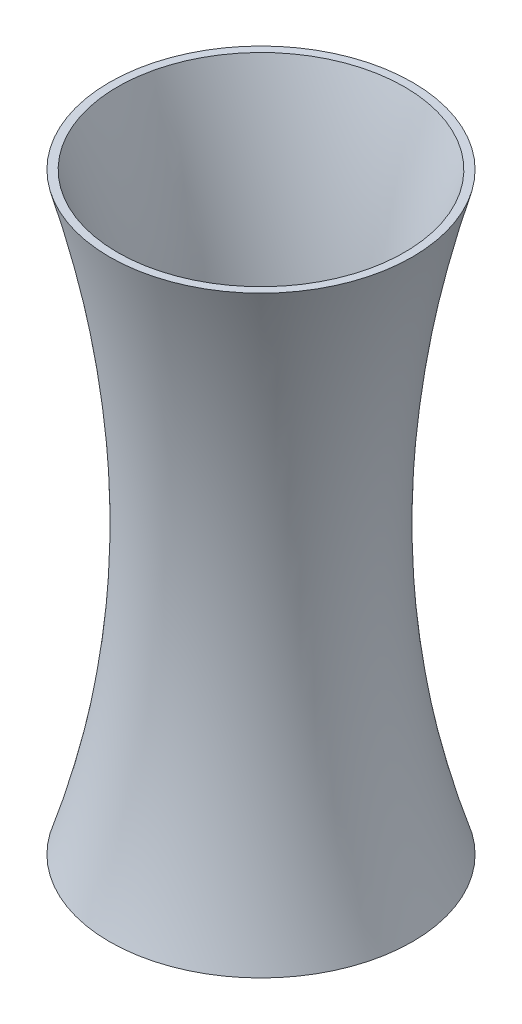
ISO-10303-21;
HEADER;
FILE_DESCRIPTION(('STEP AP214'),'2;1');
FILE_NAME('part.step','',(''),(''),'','','');
FILE_SCHEMA(('AUTOMOTIVE_DESIGN { 1 0 10303 214 1 1 1 1 }'));
ENDSEC;
DATA;
#1=APPLICATION_CONTEXT('core data for automotive mechanical design processes');
#2=APPLICATION_PROTOCOL_DEFINITION('international standard','automotive_design',2000,#1);
#3=PRODUCT_CONTEXT('',#1,'mechanical');
#4=PRODUCT('Part','Part','',(#3));
#5=PRODUCT_RELATED_PRODUCT_CATEGORY('part','',(#4));
#6=PRODUCT_DEFINITION_FORMATION('','',#4);
#7=PRODUCT_DEFINITION_CONTEXT('part definition',#1,'design');
#8=PRODUCT_DEFINITION('design','',#6,#7);
#9=PRODUCT_DEFINITION_SHAPE('','',#8);
#10=(LENGTH_UNIT() NAMED_UNIT(*) SI_UNIT(.MILLI.,.METRE.));
#11=(NAMED_UNIT(*) PLANE_ANGLE_UNIT() SI_UNIT($,.RADIAN.));
#12=(NAMED_UNIT(*) SI_UNIT($,.STERADIAN.) SOLID_ANGLE_UNIT());
#13=UNCERTAINTY_MEASURE_WITH_UNIT(LENGTH_MEASURE(1.E-05),#10,'distance_accuracy_value','');
#14=(GEOMETRIC_REPRESENTATION_CONTEXT(3) GLOBAL_UNCERTAINTY_ASSIGNED_CONTEXT((#13)) GLOBAL_UNIT_ASSIGNED_CONTEXT((#10,
#11,#12)) REPRESENTATION_CONTEXT('',''));
#15=CARTESIAN_POINT('',(0.,0.,0.));
#16=DIRECTION('',(0.,0.,1.));
#17=DIRECTION('',(1.,0.,0.));
#18=AXIS2_PLACEMENT_3D('',#15,#16,#17);
#19=CARTESIAN_POINT('',(-45.96,190.,0.));
#20=CARTESIAN_POINT('',(-17.385,101.1,0.));
#21=CARTESIAN_POINT('',(-45.96,0.,0.));
#22=B_SPLINE_CURVE_WITH_KNOTS('',2,(#19,#20,#21),.UNSPECIFIED.,.F.,.F.,(3,3),(0.,1.),.UNSPECIFIED.);
#23=CARTESIAN_POINT('',(0.,0.,0.));
#24=DIRECTION('',(0.,-1.,0.));
#25=AXIS1_PLACEMENT('',#23,#24);
#26=SURFACE_OF_REVOLUTION('',#22,#25);
#27=CARTESIAN_POINT('',(0.,0.,0.));
#28=DIRECTION('',(0.,-1.,0.));
#29=DIRECTION('',(0.,0.,-1.));
#30=AXIS2_PLACEMENT_3D('',#27,#28,#29);
#31=CIRCLE('',#30,45.96);
#32=CARTESIAN_POINT('',(0.,0.,-45.96));
#33=VERTEX_POINT('',#32);
#34=EDGE_CURVE('E53',#33,#33,#31,.T.);
#35=ORIENTED_EDGE('',*,*,#34,.T.);
#36=EDGE_LOOP('',(#35));
#37=FACE_BOUND('',#36,.T.);
#38=CARTESIAN_POINT('',(0.,190.,0.));
#39=DIRECTION('',(0.,-1.,0.));
#40=DIRECTION('',(0.,0.,-1.));
#41=AXIS2_PLACEMENT_3D('',#38,#39,#40);
#42=CIRCLE('',#41,45.96);
#43=CARTESIAN_POINT('',(0.,190.,-45.96));
#44=VERTEX_POINT('',#43);
#45=EDGE_CURVE('E10',#44,#44,#42,.T.);
#46=ORIENTED_EDGE('',*,*,#45,.F.);
#47=EDGE_LOOP('',(#46));
#48=FACE_BOUND('',#47,.T.);
#49=ADVANCED_FACE('F38',(#37,#48),#26,.F.);
#50=CARTESIAN_POINT('',(0.,190.,0.));
#51=DIRECTION('',(0.,-1.,0.));
#52=DIRECTION('',(0.,0.,-1.));
#53=AXIS2_PLACEMENT_3D('',#50,#51,#52);
#54=PLANE('',#53);
#55=CARTESIAN_POINT('',(0.,190.,0.));
#56=DIRECTION('',(0.,-1.,0.));
#57=DIRECTION('',(0.,0.,-1.));
#58=AXIS2_PLACEMENT_3D('',#55,#56,#57);
#59=CIRCLE('',#58,48.5);
#60=CARTESIAN_POINT('',(0.,190.,-48.5));
#61=VERTEX_POINT('',#60);
#62=EDGE_CURVE('E45',#61,#61,#59,.T.);
#63=ORIENTED_EDGE('',*,*,#62,.F.);
#64=EDGE_LOOP('',(#63));
#65=FACE_BOUND('',#64,.T.);
#66=ORIENTED_EDGE('',*,*,#45,.T.);
#67=EDGE_LOOP('',(#66));
#68=FACE_BOUND('',#67,.T.);
#69=ADVANCED_FACE('F72',(#65,#68),#54,.F.);
#70=CARTESIAN_POINT('',(-48.5,190.,0.));
#71=CARTESIAN_POINT('',(-19.925,88.9,0.));
#72=CARTESIAN_POINT('',(-48.5,0.,0.));
#73=B_SPLINE_CURVE_WITH_KNOTS('',2,(#70,#71,#72),.UNSPECIFIED.,.F.,.F.,(3,3),(0.,1.),.UNSPECIFIED.);
#74=CARTESIAN_POINT('',(0.,0.,0.));
#75=DIRECTION('',(0.,-1.,0.));
#76=AXIS1_PLACEMENT('',#74,#75);
#77=SURFACE_OF_REVOLUTION('',#73,#76);
#78=CARTESIAN_POINT('',(0.,0.,0.));
#79=DIRECTION('',(0.,-1.,0.));
#80=DIRECTION('',(0.,0.,-1.));
#81=AXIS2_PLACEMENT_3D('',#78,#79,#80);
#82=CIRCLE('',#81,48.5);
#83=CARTESIAN_POINT('',(0.,0.,-48.5));
#84=VERTEX_POINT('',#83);
#85=EDGE_CURVE('E49',#84,#84,#82,.T.);
#86=ORIENTED_EDGE('',*,*,#85,.F.);
#87=EDGE_LOOP('',(#86));
#88=FACE_BOUND('',#87,.T.);
#89=ORIENTED_EDGE('',*,*,#62,.T.);
#90=EDGE_LOOP('',(#89));
#91=FACE_BOUND('',#90,.T.);
#92=ADVANCED_FACE('F68',(#88,#91),#77,.T.);
#93=CARTESIAN_POINT('',(0.,0.,0.));
#94=DIRECTION('',(0.,1.,0.));
#95=DIRECTION('',(0.,0.,1.));
#96=AXIS2_PLACEMENT_3D('',#93,#94,#95);
#97=PLANE('',#96);
#98=ORIENTED_EDGE('',*,*,#34,.F.);
#99=EDGE_LOOP('',(#98));
#100=FACE_BOUND('',#99,.T.);
#101=ORIENTED_EDGE('',*,*,#85,.T.);
#102=EDGE_LOOP('',(#101));
#103=FACE_BOUND('',#102,.T.);
#104=ADVANCED_FACE('F71',(#100,#103),#97,.F.);
#105=CLOSED_SHELL('',(#49,#69,#92,#104));
#106=MANIFOLD_SOLID_BREP('B2',#105);
#107=ADVANCED_BREP_SHAPE_REPRESENTATION('',(#18,#106),#14);
#108=SHAPE_DEFINITION_REPRESENTATION(#9,#107);
ENDSEC;
END-ISO-10303-21;
